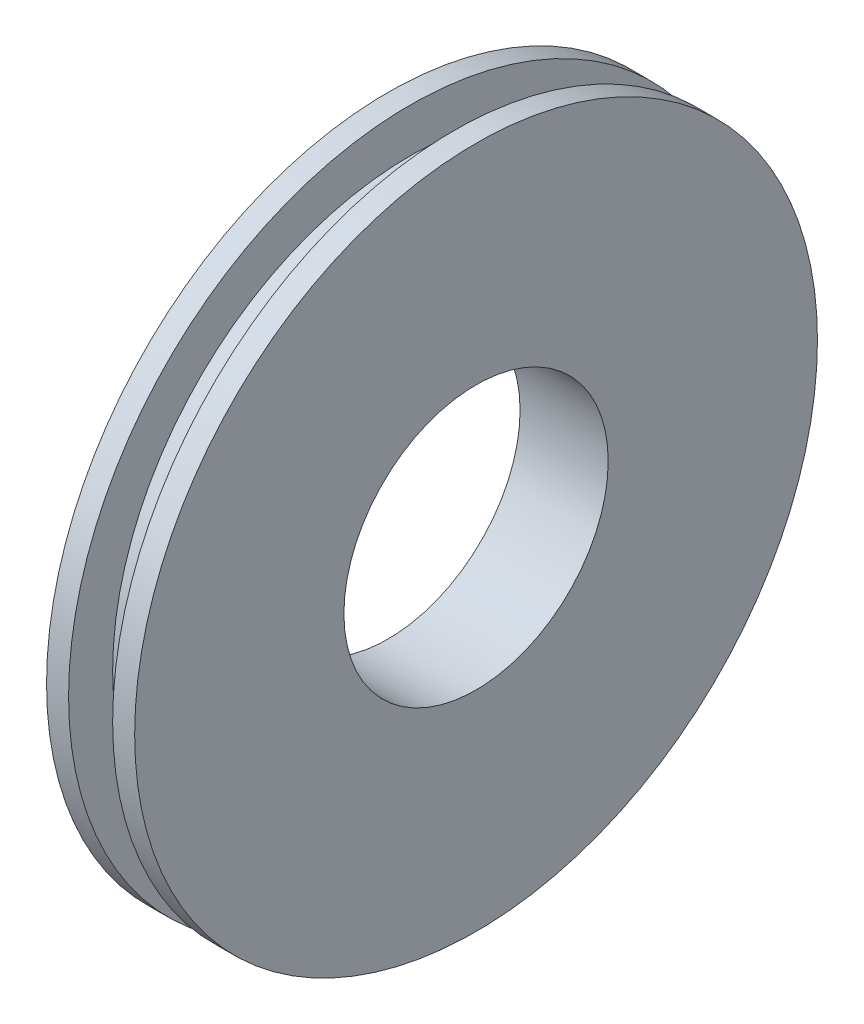
ISO-10303-21;
HEADER;
FILE_DESCRIPTION(('STEP AP214'),'2;1');
FILE_NAME('part.step','',(''),(''),'','','');
FILE_SCHEMA(('AUTOMOTIVE_DESIGN { 1 0 10303 214 1 1 1 1 }'));
ENDSEC;
DATA;
#1=APPLICATION_CONTEXT('core data for automotive mechanical design processes');
#2=APPLICATION_PROTOCOL_DEFINITION('international standard','automotive_design',2000,#1);
#3=PRODUCT_CONTEXT('',#1,'mechanical');
#4=PRODUCT('Part','Part','',(#3));
#5=PRODUCT_RELATED_PRODUCT_CATEGORY('part','',(#4));
#6=PRODUCT_DEFINITION_FORMATION('','',#4);
#7=PRODUCT_DEFINITION_CONTEXT('part definition',#1,'design');
#8=PRODUCT_DEFINITION('design','',#6,#7);
#9=PRODUCT_DEFINITION_SHAPE('','',#8);
#10=(LENGTH_UNIT() NAMED_UNIT(*) SI_UNIT(.MILLI.,.METRE.));
#11=(NAMED_UNIT(*) PLANE_ANGLE_UNIT() SI_UNIT($,.RADIAN.));
#12=(NAMED_UNIT(*) SI_UNIT($,.STERADIAN.) SOLID_ANGLE_UNIT());
#13=UNCERTAINTY_MEASURE_WITH_UNIT(LENGTH_MEASURE(1.E-05),#10,'distance_accuracy_value','');
#14=(GEOMETRIC_REPRESENTATION_CONTEXT(3) GLOBAL_UNCERTAINTY_ASSIGNED_CONTEXT((#13)) GLOBAL_UNIT_ASSIGNED_CONTEXT((#10,
#11,#12)) REPRESENTATION_CONTEXT('',''));
#15=CARTESIAN_POINT('',(0.,0.,0.));
#16=DIRECTION('',(0.,0.,1.));
#17=DIRECTION('',(1.,0.,0.));
#18=AXIS2_PLACEMENT_3D('',#15,#16,#17);
#19=CARTESIAN_POINT('',(-47.5763680581551,0.,0.));
#20=DIRECTION('',(-1.,0.,0.));
#21=DIRECTION('',(0.,0.,1.));
#22=AXIS2_PLACEMENT_3D('',#19,#20,#21);
#23=CYLINDRICAL_SURFACE('',#22,7.75);
#24=CARTESIAN_POINT('',(0.500000000000007,0.,0.));
#25=DIRECTION('',(-1.,0.,0.));
#26=DIRECTION('',(0.,0.,1.));
#27=AXIS2_PLACEMENT_3D('',#24,#25,#26);
#28=CIRCLE('',#27,7.75);
#29=CARTESIAN_POINT('',(0.500000000000007,0.,7.75));
#30=VERTEX_POINT('',#29);
#31=EDGE_CURVE('E10',#30,#30,#28,.T.);
#32=ORIENTED_EDGE('',*,*,#31,.F.);
#33=EDGE_LOOP('',(#32));
#34=FACE_BOUND('',#33,.T.);
#35=CARTESIAN_POINT('',(1.00000000000001,0.,0.));
#36=DIRECTION('',(-1.,0.,0.));
#37=DIRECTION('',(0.,0.,1.));
#38=AXIS2_PLACEMENT_3D('',#35,#36,#37);
#39=CIRCLE('',#38,7.75);
#40=CARTESIAN_POINT('',(1.00000000000001,0.,7.75));
#41=VERTEX_POINT('',#40);
#42=EDGE_CURVE('E63',#41,#41,#39,.T.);
#43=ORIENTED_EDGE('',*,*,#42,.T.);
#44=EDGE_LOOP('',(#43));
#45=FACE_BOUND('',#44,.T.);
#46=ADVANCED_FACE('F35',(#34,#45),#23,.T.);
#47=CARTESIAN_POINT('',(0.500000000000007,7.75,0.));
#48=DIRECTION('',(1.,0.,0.));
#49=DIRECTION('',(0.,0.,-1.));
#50=AXIS2_PLACEMENT_3D('',#47,#48,#49);
#51=PLANE('',#50);
#52=CARTESIAN_POINT('',(0.500000000000007,0.,0.));
#53=DIRECTION('',(-1.,0.,0.));
#54=DIRECTION('',(0.,0.,1.));
#55=AXIS2_PLACEMENT_3D('',#52,#53,#54);
#56=CIRCLE('',#55,6.75);
#57=CARTESIAN_POINT('',(0.500000000000007,0.,6.75));
#58=VERTEX_POINT('',#57);
#59=EDGE_CURVE('E41',#58,#58,#56,.T.);
#60=ORIENTED_EDGE('',*,*,#59,.F.);
#61=EDGE_LOOP('',(#60));
#62=FACE_BOUND('',#61,.T.);
#63=ORIENTED_EDGE('',*,*,#31,.T.);
#64=EDGE_LOOP('',(#63));
#65=FACE_BOUND('',#64,.T.);
#66=ADVANCED_FACE('F100',(#62,#65),#51,.F.);
#67=CARTESIAN_POINT('',(-47.5763680581551,0.,0.));
#68=DIRECTION('',(-1.,0.,0.));
#69=DIRECTION('',(0.,0.,1.));
#70=AXIS2_PLACEMENT_3D('',#67,#68,#69);
#71=CYLINDRICAL_SURFACE('',#70,6.75);
#72=CARTESIAN_POINT('',(-0.499999999999994,0.,0.));
#73=DIRECTION('',(-1.,0.,0.));
#74=DIRECTION('',(0.,0.,1.));
#75=AXIS2_PLACEMENT_3D('',#72,#73,#74);
#76=CIRCLE('',#75,6.75);
#77=CARTESIAN_POINT('',(-0.499999999999994,0.,6.75));
#78=VERTEX_POINT('',#77);
#79=EDGE_CURVE('E45',#78,#78,#76,.T.);
#80=ORIENTED_EDGE('',*,*,#79,.F.);
#81=EDGE_LOOP('',(#80));
#82=FACE_BOUND('',#81,.T.);
#83=ORIENTED_EDGE('',*,*,#59,.T.);
#84=EDGE_LOOP('',(#83));
#85=FACE_BOUND('',#84,.T.);
#86=ADVANCED_FACE('F95',(#82,#85),#71,.T.);
#87=CARTESIAN_POINT('',(-0.499999999999993,7.75,0.));
#88=DIRECTION('',(-1.,0.,0.));
#89=DIRECTION('',(0.,0.,1.));
#90=AXIS2_PLACEMENT_3D('',#87,#88,#89);
#91=PLANE('',#90);
#92=CARTESIAN_POINT('',(-0.499999999999994,0.,0.));
#93=DIRECTION('',(-1.,0.,0.));
#94=DIRECTION('',(0.,0.,1.));
#95=AXIS2_PLACEMENT_3D('',#92,#93,#94);
#96=CIRCLE('',#95,7.75);
#97=CARTESIAN_POINT('',(-0.499999999999994,0.,7.75));
#98=VERTEX_POINT('',#97);
#99=EDGE_CURVE('E49',#98,#98,#96,.T.);
#100=ORIENTED_EDGE('',*,*,#99,.F.);
#101=EDGE_LOOP('',(#100));
#102=FACE_BOUND('',#101,.T.);
#103=ORIENTED_EDGE('',*,*,#79,.T.);
#104=EDGE_LOOP('',(#103));
#105=FACE_BOUND('',#104,.T.);
#106=ADVANCED_FACE('F89',(#102,#105),#91,.F.);
#107=CARTESIAN_POINT('',(-47.5763680581551,0.,0.));
#108=DIRECTION('',(-1.,0.,0.));
#109=DIRECTION('',(0.,0.,1.));
#110=AXIS2_PLACEMENT_3D('',#107,#108,#109);
#111=CYLINDRICAL_SURFACE('',#110,7.75);
#112=CARTESIAN_POINT('',(-0.999999999999994,0.,0.));
#113=DIRECTION('',(-1.,0.,0.));
#114=DIRECTION('',(0.,0.,1.));
#115=AXIS2_PLACEMENT_3D('',#112,#113,#114);
#116=CIRCLE('',#115,7.75);
#117=CARTESIAN_POINT('',(-0.999999999999994,0.,7.75));
#118=VERTEX_POINT('',#117);
#119=EDGE_CURVE('E54',#118,#118,#116,.T.);
#120=ORIENTED_EDGE('',*,*,#119,.F.);
#121=EDGE_LOOP('',(#120));
#122=FACE_BOUND('',#121,.T.);
#123=ORIENTED_EDGE('',*,*,#99,.T.);
#124=EDGE_LOOP('',(#123));
#125=FACE_BOUND('',#124,.T.);
#126=ADVANCED_FACE('F83',(#122,#125),#111,.T.);
#127=CARTESIAN_POINT('',(-0.999999999999993,3.,0.));
#128=DIRECTION('',(1.,0.,0.));
#129=DIRECTION('',(0.,0.,-1.));
#130=AXIS2_PLACEMENT_3D('',#127,#128,#129);
#131=PLANE('',#130);
#132=CARTESIAN_POINT('',(-0.999999999999994,0.,0.));
#133=DIRECTION('',(-1.,0.,0.));
#134=DIRECTION('',(0.,0.,1.));
#135=AXIS2_PLACEMENT_3D('',#132,#133,#134);
#136=CIRCLE('',#135,3.);
#137=CARTESIAN_POINT('',(-0.999999999999994,0.,3.));
#138=VERTEX_POINT('',#137);
#139=EDGE_CURVE('E57',#138,#138,#136,.T.);
#140=ORIENTED_EDGE('',*,*,#139,.F.);
#141=EDGE_LOOP('',(#140));
#142=FACE_BOUND('',#141,.T.);
#143=ORIENTED_EDGE('',*,*,#119,.T.);
#144=EDGE_LOOP('',(#143));
#145=FACE_BOUND('',#144,.T.);
#146=ADVANCED_FACE('F77',(#142,#145),#131,.F.);
#147=CARTESIAN_POINT('',(-47.5763680581551,0.,0.));
#148=DIRECTION('',(-1.,0.,0.));
#149=DIRECTION('',(0.,0.,1.));
#150=AXIS2_PLACEMENT_3D('',#147,#148,#149);
#151=CYLINDRICAL_SURFACE('',#150,3.);
#152=CARTESIAN_POINT('',(1.00000000000001,0.,0.));
#153=DIRECTION('',(-1.,0.,0.));
#154=DIRECTION('',(0.,0.,1.));
#155=AXIS2_PLACEMENT_3D('',#152,#153,#154);
#156=CIRCLE('',#155,3.);
#157=CARTESIAN_POINT('',(1.00000000000001,0.,3.));
#158=VERTEX_POINT('',#157);
#159=EDGE_CURVE('E60',#158,#158,#156,.T.);
#160=ORIENTED_EDGE('',*,*,#159,.F.);
#161=EDGE_LOOP('',(#160));
#162=FACE_BOUND('',#161,.T.);
#163=ORIENTED_EDGE('',*,*,#139,.T.);
#164=EDGE_LOOP('',(#163));
#165=FACE_BOUND('',#164,.T.);
#166=ADVANCED_FACE('F71',(#162,#165),#151,.F.);
#167=CARTESIAN_POINT('',(1.00000000000001,3.,0.));
#168=DIRECTION('',(-1.,0.,0.));
#169=DIRECTION('',(0.,0.,1.));
#170=AXIS2_PLACEMENT_3D('',#167,#168,#169);
#171=PLANE('',#170);
#172=ORIENTED_EDGE('',*,*,#42,.F.);
#173=EDGE_LOOP('',(#172));
#174=FACE_BOUND('',#173,.T.);
#175=ORIENTED_EDGE('',*,*,#159,.T.);
#176=EDGE_LOOP('',(#175));
#177=FACE_BOUND('',#176,.T.);
#178=ADVANCED_FACE('F68',(#174,#177),#171,.F.);
#179=CLOSED_SHELL('',(#46,#66,#86,#106,#126,#146,#166,#178));
#180=MANIFOLD_SOLID_BREP('B2',#179);
#181=ADVANCED_BREP_SHAPE_REPRESENTATION('',(#18,#180),#14);
#182=SHAPE_DEFINITION_REPRESENTATION(#9,#181);
ENDSEC;
END-ISO-10303-21;
